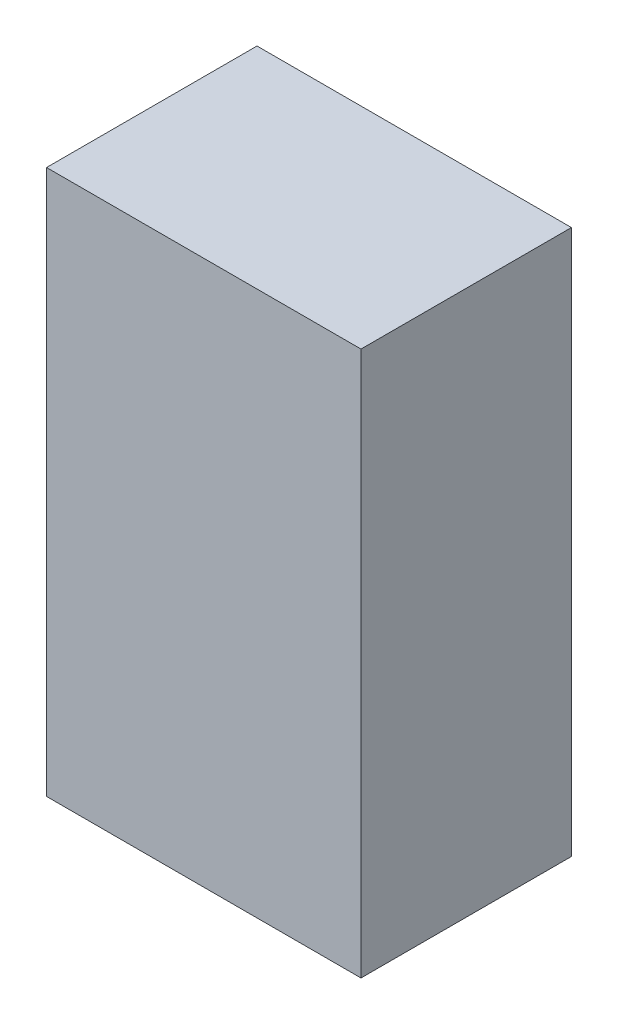
ISO-10303-21;
HEADER;
FILE_DESCRIPTION(('STEP AP214'),'2;1');
FILE_NAME('part.step','',(''),(''),'','','');
FILE_SCHEMA(('AUTOMOTIVE_DESIGN { 1 0 10303 214 1 1 1 1 }'));
ENDSEC;
DATA;
#1=APPLICATION_CONTEXT('core data for automotive mechanical design processes');
#2=APPLICATION_PROTOCOL_DEFINITION('international standard','automotive_design',2000,#1);
#3=PRODUCT_CONTEXT('',#1,'mechanical');
#4=PRODUCT('Part','Part','',(#3));
#5=PRODUCT_RELATED_PRODUCT_CATEGORY('part','',(#4));
#6=PRODUCT_DEFINITION_FORMATION('','',#4);
#7=PRODUCT_DEFINITION_CONTEXT('part definition',#1,'design');
#8=PRODUCT_DEFINITION('design','',#6,#7);
#9=PRODUCT_DEFINITION_SHAPE('','',#8);
#10=(LENGTH_UNIT() NAMED_UNIT(*) SI_UNIT(.MILLI.,.METRE.));
#11=(NAMED_UNIT(*) PLANE_ANGLE_UNIT() SI_UNIT($,.RADIAN.));
#12=(NAMED_UNIT(*) SI_UNIT($,.STERADIAN.) SOLID_ANGLE_UNIT());
#13=UNCERTAINTY_MEASURE_WITH_UNIT(LENGTH_MEASURE(1.E-05),#10,'distance_accuracy_value','');
#14=(GEOMETRIC_REPRESENTATION_CONTEXT(3) GLOBAL_UNCERTAINTY_ASSIGNED_CONTEXT((#13)) GLOBAL_UNIT_ASSIGNED_CONTEXT((#10,
#11,#12)) REPRESENTATION_CONTEXT('',''));
#15=CARTESIAN_POINT('',(0.,0.,0.));
#16=DIRECTION('',(0.,0.,1.));
#17=DIRECTION('',(1.,0.,0.));
#18=AXIS2_PLACEMENT_3D('',#15,#16,#17);
#19=CARTESIAN_POINT('',(-0.635,1.10000034,0.85));
#20=DIRECTION('',(0.,0.,1.));
#21=DIRECTION('',(1.,0.,0.));
#22=AXIS2_PLACEMENT_3D('',#19,#20,#21);
#23=PLANE('',#22);
#24=DIRECTION('',(0.,1.,0.));
#25=VECTOR('',#24,1.);
#26=CARTESIAN_POINT('',(0.635,1.10000034,0.85));
#27=LINE('',#26,#25);
#28=CARTESIAN_POINT('',(0.635,1.10000034,0.85));
#29=VERTEX_POINT('',#28);
#30=CARTESIAN_POINT('',(0.635,-1.10000034,0.85));
#31=VERTEX_POINT('',#30);
#32=EDGE_CURVE('E53',#29,#31,#27,.F.);
#33=ORIENTED_EDGE('',*,*,#32,.F.);
#34=DIRECTION('',(1.,0.,0.));
#35=VECTOR('',#34,1.);
#36=CARTESIAN_POINT('',(-0.635,1.10000034,0.85));
#37=LINE('',#36,#35);
#38=CARTESIAN_POINT('',(-0.635,1.10000034,0.85));
#39=VERTEX_POINT('',#38);
#40=EDGE_CURVE('E20',#29,#39,#37,.F.);
#41=ORIENTED_EDGE('',*,*,#40,.T.);
#42=DIRECTION('',(0.,1.,0.));
#43=VECTOR('',#42,1.);
#44=CARTESIAN_POINT('',(-0.635,-1.10000034,0.85));
#45=LINE('',#44,#43);
#46=CARTESIAN_POINT('',(-0.635,-1.10000034,0.85));
#47=VERTEX_POINT('',#46);
#48=EDGE_CURVE('E67',#47,#39,#45,.T.);
#49=ORIENTED_EDGE('',*,*,#48,.F.);
#50=DIRECTION('',(1.,0.,0.));
#51=VECTOR('',#50,1.);
#52=CARTESIAN_POINT('',(0.635,-1.10000034,0.85));
#53=LINE('',#52,#51);
#54=EDGE_CURVE('E58',#31,#47,#53,.F.);
#55=ORIENTED_EDGE('',*,*,#54,.F.);
#56=EDGE_LOOP('',(#33,#41,#49,#55));
#57=FACE_BOUND('',#56,.T.);
#58=ADVANCED_FACE('F17',(#57),#23,.T.);
#59=CARTESIAN_POINT('',(-0.635,-1.10000034,0.));
#60=DIRECTION('',(-1.,0.,0.));
#61=DIRECTION('',(0.,0.,1.));
#62=AXIS2_PLACEMENT_3D('',#59,#60,#61);
#63=PLANE('',#62);
#64=DIRECTION('',(0.,0.,1.));
#65=VECTOR('',#64,1.);
#66=CARTESIAN_POINT('',(-0.635,1.10000034,0.));
#67=LINE('',#66,#65);
#68=CARTESIAN_POINT('',(-0.635,1.10000034,0.));
#69=VERTEX_POINT('',#68);
#70=EDGE_CURVE('E80',#69,#39,#67,.T.);
#71=ORIENTED_EDGE('',*,*,#70,.F.);
#72=DIRECTION('',(0.,1.,0.));
#73=VECTOR('',#72,1.);
#74=CARTESIAN_POINT('',(-0.635,1.10000034,0.));
#75=LINE('',#74,#73);
#76=CARTESIAN_POINT('',(-0.635,-1.10000034,0.));
#77=VERTEX_POINT('',#76);
#78=EDGE_CURVE('E75',#69,#77,#75,.F.);
#79=ORIENTED_EDGE('',*,*,#78,.T.);
#80=DIRECTION('',(0.,0.,-1.));
#81=VECTOR('',#80,1.);
#82=CARTESIAN_POINT('',(-0.635,-1.10000034,0.));
#83=LINE('',#82,#81);
#84=EDGE_CURVE('E63',#47,#77,#83,.T.);
#85=ORIENTED_EDGE('',*,*,#84,.F.);
#86=ORIENTED_EDGE('',*,*,#48,.T.);
#87=EDGE_LOOP('',(#71,#79,#85,#86));
#88=FACE_BOUND('',#87,.T.);
#89=ADVANCED_FACE('F74',(#88),#63,.T.);
#90=CARTESIAN_POINT('',(0.635,-1.10000034,0.));
#91=DIRECTION('',(0.,-1.,0.));
#92=DIRECTION('',(0.,0.,-1.));
#93=AXIS2_PLACEMENT_3D('',#90,#91,#92);
#94=PLANE('',#93);
#95=ORIENTED_EDGE('',*,*,#84,.T.);
#96=DIRECTION('',(1.,0.,0.));
#97=VECTOR('',#96,1.);
#98=CARTESIAN_POINT('',(-0.635,-1.10000034,0.));
#99=LINE('',#98,#97);
#100=CARTESIAN_POINT('',(0.635,-1.10000034,0.));
#101=VERTEX_POINT('',#100);
#102=EDGE_CURVE('E84',#77,#101,#99,.T.);
#103=ORIENTED_EDGE('',*,*,#102,.T.);
#104=DIRECTION('',(0.,0.,-1.));
#105=VECTOR('',#104,1.);
#106=CARTESIAN_POINT('',(0.635,-1.10000034,0.));
#107=LINE('',#106,#105);
#108=EDGE_CURVE('E65',#31,#101,#107,.T.);
#109=ORIENTED_EDGE('',*,*,#108,.F.);
#110=ORIENTED_EDGE('',*,*,#54,.T.);
#111=EDGE_LOOP('',(#95,#103,#109,#110));
#112=FACE_BOUND('',#111,.T.);
#113=ADVANCED_FACE('F60',(#112),#94,.T.);
#114=CARTESIAN_POINT('',(0.635,1.10000034,0.));
#115=DIRECTION('',(1.,0.,0.));
#116=DIRECTION('',(0.,0.,-1.));
#117=AXIS2_PLACEMENT_3D('',#114,#115,#116);
#118=PLANE('',#117);
#119=ORIENTED_EDGE('',*,*,#108,.T.);
#120=DIRECTION('',(0.,1.,0.));
#121=VECTOR('',#120,1.);
#122=CARTESIAN_POINT('',(0.635,1.10000034,0.));
#123=LINE('',#122,#121);
#124=CARTESIAN_POINT('',(0.635,1.10000034,0.));
#125=VERTEX_POINT('',#124);
#126=EDGE_CURVE('E26',#101,#125,#123,.T.);
#127=ORIENTED_EDGE('',*,*,#126,.T.);
#128=DIRECTION('',(0.,0.,1.));
#129=VECTOR('',#128,1.);
#130=CARTESIAN_POINT('',(0.635,1.10000034,0.));
#131=LINE('',#130,#129);
#132=EDGE_CURVE('E34',#29,#125,#131,.F.);
#133=ORIENTED_EDGE('',*,*,#132,.F.);
#134=ORIENTED_EDGE('',*,*,#32,.T.);
#135=EDGE_LOOP('',(#119,#127,#133,#134));
#136=FACE_BOUND('',#135,.T.);
#137=ADVANCED_FACE('F88',(#136),#118,.T.);
#138=CARTESIAN_POINT('',(-0.635,1.10000034,0.));
#139=DIRECTION('',(0.,1.,0.));
#140=DIRECTION('',(0.,0.,1.));
#141=AXIS2_PLACEMENT_3D('',#138,#139,#140);
#142=PLANE('',#141);
#143=ORIENTED_EDGE('',*,*,#132,.T.);
#144=DIRECTION('',(1.,0.,0.));
#145=VECTOR('',#144,1.);
#146=CARTESIAN_POINT('',(-0.635,1.10000034,0.));
#147=LINE('',#146,#145);
#148=EDGE_CURVE('E11',#125,#69,#147,.F.);
#149=ORIENTED_EDGE('',*,*,#148,.T.);
#150=ORIENTED_EDGE('',*,*,#70,.T.);
#151=ORIENTED_EDGE('',*,*,#40,.F.);
#152=EDGE_LOOP('',(#143,#149,#150,#151));
#153=FACE_BOUND('',#152,.T.);
#154=ADVANCED_FACE('F91',(#153),#142,.T.);
#155=CARTESIAN_POINT('',(-0.635,1.10000034,0.));
#156=DIRECTION('',(0.,0.,1.));
#157=DIRECTION('',(1.,0.,0.));
#158=AXIS2_PLACEMENT_3D('',#155,#156,#157);
#159=PLANE('',#158);
#160=ORIENTED_EDGE('',*,*,#126,.F.);
#161=ORIENTED_EDGE('',*,*,#102,.F.);
#162=ORIENTED_EDGE('',*,*,#78,.F.);
#163=ORIENTED_EDGE('',*,*,#148,.F.);
#164=EDGE_LOOP('',(#160,#161,#162,#163));
#165=FACE_BOUND('',#164,.T.);
#166=ADVANCED_FACE('F90',(#165),#159,.F.);
#167=CLOSED_SHELL('',(#58,#89,#113,#137,#154,#166));
#168=MANIFOLD_SOLID_BREP('B1',#167);
#169=ADVANCED_BREP_SHAPE_REPRESENTATION('',(#18,#168),#14);
#170=SHAPE_DEFINITION_REPRESENTATION(#9,#169);
ENDSEC;
END-ISO-10303-21;
